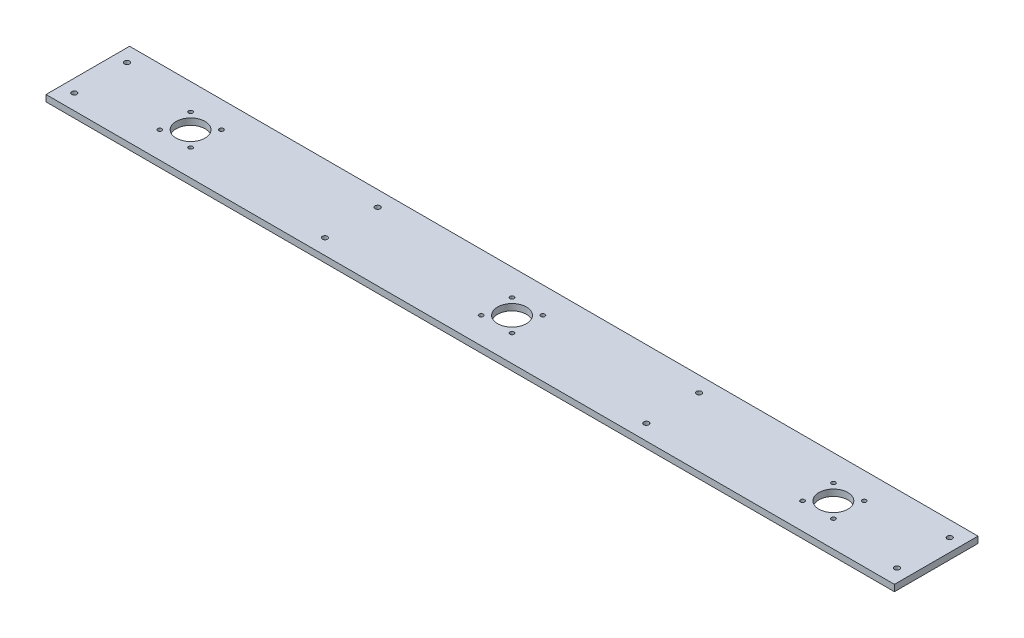
ISO-10303-21;
HEADER;
FILE_DESCRIPTION(('STEP AP214'),'2;1');
FILE_NAME('part.step','',(''),(''),'','','');
FILE_SCHEMA(('AUTOMOTIVE_DESIGN { 1 0 10303 214 1 1 1 1 }'));
ENDSEC;
DATA;
#1=APPLICATION_CONTEXT('core data for automotive mechanical design processes');
#2=APPLICATION_PROTOCOL_DEFINITION('international standard','automotive_design',2000,#1);
#3=PRODUCT_CONTEXT('',#1,'mechanical');
#4=PRODUCT('Part','Part','',(#3));
#5=PRODUCT_RELATED_PRODUCT_CATEGORY('part','',(#4));
#6=PRODUCT_DEFINITION_FORMATION('','',#4);
#7=PRODUCT_DEFINITION_CONTEXT('part definition',#1,'design');
#8=PRODUCT_DEFINITION('design','',#6,#7);
#9=PRODUCT_DEFINITION_SHAPE('','',#8);
#10=(LENGTH_UNIT() NAMED_UNIT(*) SI_UNIT(.MILLI.,.METRE.));
#11=(NAMED_UNIT(*) PLANE_ANGLE_UNIT() SI_UNIT($,.RADIAN.));
#12=(NAMED_UNIT(*) SI_UNIT($,.STERADIAN.) SOLID_ANGLE_UNIT());
#13=UNCERTAINTY_MEASURE_WITH_UNIT(LENGTH_MEASURE(1.E-05),#10,'distance_accuracy_value','');
#14=(GEOMETRIC_REPRESENTATION_CONTEXT(3) GLOBAL_UNCERTAINTY_ASSIGNED_CONTEXT((#13)) GLOBAL_UNIT_ASSIGNED_CONTEXT((#10,
#11,#12)) REPRESENTATION_CONTEXT('',''));
#15=CARTESIAN_POINT('',(0.,0.,0.));
#16=DIRECTION('',(0.,0.,1.));
#17=DIRECTION('',(1.,0.,0.));
#18=AXIS2_PLACEMENT_3D('',#15,#16,#17);
#19=CARTESIAN_POINT('',(0.,0.,0.));
#20=DIRECTION('',(0.,-1.,0.));
#21=DIRECTION('',(0.,0.,-1.));
#22=AXIS2_PLACEMENT_3D('',#19,#20,#21);
#23=PLANE('',#22);
#24=DIRECTION('',(0.,0.,-1.));
#25=VECTOR('',#24,1.);
#26=CARTESIAN_POINT('',(-419.1,0.,9.525));
#27=LINE('',#26,#25);
#28=CARTESIAN_POINT('',(-419.1,0.,-41.275));
#29=VERTEX_POINT('',#28);
#30=CARTESIAN_POINT('',(-419.1,0.,41.275));
#31=VERTEX_POINT('',#30);
#32=EDGE_CURVE('E230',#29,#31,#27,.F.);
#33=ORIENTED_EDGE('',*,*,#32,.T.);
#34=DIRECTION('',(-1.,0.,0.));
#35=VECTOR('',#34,1.);
#36=CARTESIAN_POINT('',(-311.816079656319,0.,41.275));
#37=LINE('',#36,#35);
#38=CARTESIAN_POINT('',(419.1,0.,41.275));
#39=VERTEX_POINT('',#38);
#40=EDGE_CURVE('E63',#31,#39,#37,.F.);
#41=ORIENTED_EDGE('',*,*,#40,.T.);
#42=DIRECTION('',(0.,0.,-1.));
#43=VECTOR('',#42,1.);
#44=CARTESIAN_POINT('',(419.1,0.,9.52499999999978));
#45=LINE('',#44,#43);
#46=CARTESIAN_POINT('',(419.1,0.,-41.275));
#47=VERTEX_POINT('',#46);
#48=EDGE_CURVE('E55',#47,#39,#45,.F.);
#49=ORIENTED_EDGE('',*,*,#48,.F.);
#50=DIRECTION('',(-1.,0.,0.));
#51=VECTOR('',#50,1.);
#52=CARTESIAN_POINT('',(0.,0.,-41.275));
#53=LINE('',#52,#51);
#54=EDGE_CURVE('E61',#29,#47,#53,.F.);
#55=ORIENTED_EDGE('',*,*,#54,.F.);
#56=EDGE_LOOP('',(#33,#41,#49,#55));
#57=FACE_BOUND('',#56,.T.);
#58=CARTESIAN_POINT('',(-317.5,0.,0.));
#59=DIRECTION('',(0.,1.,0.));
#60=DIRECTION('',(0.,0.,1.));
#61=AXIS2_PLACEMENT_3D('',#58,#59,#60);
#62=CIRCLE('',#61,14.2875);
#63=CARTESIAN_POINT('',(-317.5,0.,14.2875));
#64=VERTEX_POINT('',#63);
#65=EDGE_CURVE('E226',#64,#64,#62,.F.);
#66=ORIENTED_EDGE('',*,*,#65,.T.);
#67=EDGE_LOOP('',(#66));
#68=FACE_BOUND('',#67,.T.);
#69=CARTESIAN_POINT('',(-332.74,0.,15.24));
#70=DIRECTION('',(0.,1.,0.));
#71=DIRECTION('',(0.,0.,1.));
#72=AXIS2_PLACEMENT_3D('',#69,#70,#71);
#73=CIRCLE('',#72,2.032);
#74=CARTESIAN_POINT('',(-332.74,0.,17.272));
#75=VERTEX_POINT('',#74);
#76=EDGE_CURVE('E222',#75,#75,#73,.F.);
#77=ORIENTED_EDGE('',*,*,#76,.T.);
#78=EDGE_LOOP('',(#77));
#79=FACE_BOUND('',#78,.T.);
#80=CARTESIAN_POINT('',(0.,0.,0.));
#81=DIRECTION('',(0.,1.,0.));
#82=DIRECTION('',(0.,0.,1.));
#83=AXIS2_PLACEMENT_3D('',#80,#81,#82);
#84=CIRCLE('',#83,14.2875);
#85=CARTESIAN_POINT('',(0.,0.,14.2875));
#86=VERTEX_POINT('',#85);
#87=EDGE_CURVE('E218',#86,#86,#84,.F.);
#88=ORIENTED_EDGE('',*,*,#87,.T.);
#89=EDGE_LOOP('',(#88));
#90=FACE_BOUND('',#89,.T.);
#91=CARTESIAN_POINT('',(-302.26,0.,15.24));
#92=DIRECTION('',(0.,1.,0.));
#93=DIRECTION('',(0.,0.,1.));
#94=AXIS2_PLACEMENT_3D('',#91,#92,#93);
#95=CIRCLE('',#94,2.032);
#96=CARTESIAN_POINT('',(-302.26,0.,17.272));
#97=VERTEX_POINT('',#96);
#98=EDGE_CURVE('E214',#97,#97,#95,.F.);
#99=ORIENTED_EDGE('',*,*,#98,.T.);
#100=EDGE_LOOP('',(#99));
#101=FACE_BOUND('',#100,.T.);
#102=CARTESIAN_POINT('',(-302.26,0.,-15.24));
#103=DIRECTION('',(0.,1.,0.));
#104=DIRECTION('',(0.,0.,1.));
#105=AXIS2_PLACEMENT_3D('',#102,#103,#104);
#106=CIRCLE('',#105,2.032);
#107=CARTESIAN_POINT('',(-302.26,0.,-13.208));
#108=VERTEX_POINT('',#107);
#109=EDGE_CURVE('E210',#108,#108,#106,.F.);
#110=ORIENTED_EDGE('',*,*,#109,.T.);
#111=EDGE_LOOP('',(#110));
#112=FACE_BOUND('',#111,.T.);
#113=CARTESIAN_POINT('',(-332.74,0.,-15.24));
#114=DIRECTION('',(0.,1.,0.));
#115=DIRECTION('',(0.,0.,1.));
#116=AXIS2_PLACEMENT_3D('',#113,#114,#115);
#117=CIRCLE('',#116,2.032);
#118=CARTESIAN_POINT('',(-332.74,0.,-13.208));
#119=VERTEX_POINT('',#118);
#120=EDGE_CURVE('E206',#119,#119,#117,.F.);
#121=ORIENTED_EDGE('',*,*,#120,.T.);
#122=EDGE_LOOP('',(#121));
#123=FACE_BOUND('',#122,.T.);
#124=CARTESIAN_POINT('',(15.24,0.,-15.24));
#125=DIRECTION('',(0.,1.,0.));
#126=DIRECTION('',(0.,0.,1.));
#127=AXIS2_PLACEMENT_3D('',#124,#125,#126);
#128=CIRCLE('',#127,2.032);
#129=CARTESIAN_POINT('',(15.24,0.,-13.208));
#130=VERTEX_POINT('',#129);
#131=EDGE_CURVE('E202',#130,#130,#128,.F.);
#132=ORIENTED_EDGE('',*,*,#131,.T.);
#133=EDGE_LOOP('',(#132));
#134=FACE_BOUND('',#133,.T.);
#135=CARTESIAN_POINT('',(15.24,0.,15.24));
#136=DIRECTION('',(0.,1.,0.));
#137=DIRECTION('',(0.,0.,1.));
#138=AXIS2_PLACEMENT_3D('',#135,#136,#137);
#139=CIRCLE('',#138,2.032);
#140=CARTESIAN_POINT('',(15.24,0.,17.272));
#141=VERTEX_POINT('',#140);
#142=EDGE_CURVE('E198',#141,#141,#139,.F.);
#143=ORIENTED_EDGE('',*,*,#142,.T.);
#144=EDGE_LOOP('',(#143));
#145=FACE_BOUND('',#144,.T.);
#146=CARTESIAN_POINT('',(-15.24,0.,15.24));
#147=DIRECTION('',(0.,1.,0.));
#148=DIRECTION('',(0.,0.,1.));
#149=AXIS2_PLACEMENT_3D('',#146,#147,#148);
#150=CIRCLE('',#149,2.032);
#151=CARTESIAN_POINT('',(-15.24,0.,17.272));
#152=VERTEX_POINT('',#151);
#153=EDGE_CURVE('E194',#152,#152,#150,.F.);
#154=ORIENTED_EDGE('',*,*,#153,.T.);
#155=EDGE_LOOP('',(#154));
#156=FACE_BOUND('',#155,.T.);
#157=CARTESIAN_POINT('',(-15.24,0.,-15.24));
#158=DIRECTION('',(0.,1.,0.));
#159=DIRECTION('',(0.,0.,1.));
#160=AXIS2_PLACEMENT_3D('',#157,#158,#159);
#161=CIRCLE('',#160,2.032);
#162=CARTESIAN_POINT('',(-15.24,0.,-13.208));
#163=VERTEX_POINT('',#162);
#164=EDGE_CURVE('E190',#163,#163,#161,.F.);
#165=ORIENTED_EDGE('',*,*,#164,.T.);
#166=EDGE_LOOP('',(#165));
#167=FACE_BOUND('',#166,.T.);
#168=CARTESIAN_POINT('',(317.5,0.,0.));
#169=DIRECTION('',(0.,1.,0.));
#170=DIRECTION('',(0.,0.,1.));
#171=AXIS2_PLACEMENT_3D('',#168,#169,#170);
#172=CIRCLE('',#171,14.2875);
#173=CARTESIAN_POINT('',(317.5,0.,14.2875));
#174=VERTEX_POINT('',#173);
#175=EDGE_CURVE('E186',#174,#174,#172,.F.);
#176=ORIENTED_EDGE('',*,*,#175,.T.);
#177=EDGE_LOOP('',(#176));
#178=FACE_BOUND('',#177,.T.);
#179=CARTESIAN_POINT('',(332.74,0.,15.24));
#180=DIRECTION('',(0.,1.,0.));
#181=DIRECTION('',(0.,0.,1.));
#182=AXIS2_PLACEMENT_3D('',#179,#180,#181);
#183=CIRCLE('',#182,2.032);
#184=CARTESIAN_POINT('',(332.74,0.,17.272));
#185=VERTEX_POINT('',#184);
#186=EDGE_CURVE('E75',#185,#185,#183,.F.);
#187=ORIENTED_EDGE('',*,*,#186,.T.);
#188=EDGE_LOOP('',(#187));
#189=FACE_BOUND('',#188,.T.);
#190=CARTESIAN_POINT('',(302.26,0.,15.24));
#191=DIRECTION('',(0.,1.,0.));
#192=DIRECTION('',(0.,0.,1.));
#193=AXIS2_PLACEMENT_3D('',#190,#191,#192);
#194=CIRCLE('',#193,2.032);
#195=CARTESIAN_POINT('',(302.26,0.,17.272));
#196=VERTEX_POINT('',#195);
#197=EDGE_CURVE('E182',#196,#196,#194,.F.);
#198=ORIENTED_EDGE('',*,*,#197,.T.);
#199=EDGE_LOOP('',(#198));
#200=FACE_BOUND('',#199,.T.);
#201=CARTESIAN_POINT('',(302.26,0.,-15.24));
#202=DIRECTION('',(0.,1.,0.));
#203=DIRECTION('',(0.,0.,1.));
#204=AXIS2_PLACEMENT_3D('',#201,#202,#203);
#205=CIRCLE('',#204,2.032);
#206=CARTESIAN_POINT('',(302.26,0.,-13.208));
#207=VERTEX_POINT('',#206);
#208=EDGE_CURVE('E234',#207,#207,#205,.F.);
#209=ORIENTED_EDGE('',*,*,#208,.T.);
#210=EDGE_LOOP('',(#209));
#211=FACE_BOUND('',#210,.T.);
#212=CARTESIAN_POINT('',(332.74,0.,-15.24));
#213=DIRECTION('',(0.,1.,0.));
#214=DIRECTION('',(0.,0.,1.));
#215=AXIS2_PLACEMENT_3D('',#212,#213,#214);
#216=CIRCLE('',#215,2.032);
#217=CARTESIAN_POINT('',(332.74,0.,-13.208));
#218=VERTEX_POINT('',#217);
#219=EDGE_CURVE('E178',#218,#218,#216,.F.);
#220=ORIENTED_EDGE('',*,*,#219,.T.);
#221=EDGE_LOOP('',(#220));
#222=FACE_BOUND('',#221,.T.);
#223=CARTESIAN_POINT('',(-406.4,0.,-26.035));
#224=DIRECTION('',(0.,1.,0.));
#225=DIRECTION('',(0.,0.,1.));
#226=AXIS2_PLACEMENT_3D('',#223,#224,#225);
#227=CIRCLE('',#226,2.54);
#228=CARTESIAN_POINT('',(-406.4,0.,-23.495));
#229=VERTEX_POINT('',#228);
#230=EDGE_CURVE('E238',#229,#229,#227,.F.);
#231=ORIENTED_EDGE('',*,*,#230,.T.);
#232=EDGE_LOOP('',(#231));
#233=FACE_BOUND('',#232,.T.);
#234=CARTESIAN_POINT('',(-158.75,0.,26.035));
#235=DIRECTION('',(0.,1.,0.));
#236=DIRECTION('',(0.,0.,1.));
#237=AXIS2_PLACEMENT_3D('',#234,#235,#236);
#238=CIRCLE('',#237,2.54);
#239=CARTESIAN_POINT('',(-158.75,0.,28.575));
#240=VERTEX_POINT('',#239);
#241=EDGE_CURVE('E242',#240,#240,#238,.F.);
#242=ORIENTED_EDGE('',*,*,#241,.T.);
#243=EDGE_LOOP('',(#242));
#244=FACE_BOUND('',#243,.T.);
#245=CARTESIAN_POINT('',(-158.75,0.,-26.035));
#246=DIRECTION('',(0.,1.,0.));
#247=DIRECTION('',(0.,0.,1.));
#248=AXIS2_PLACEMENT_3D('',#245,#246,#247);
#249=CIRCLE('',#248,2.54);
#250=CARTESIAN_POINT('',(-158.75,0.,-23.495));
#251=VERTEX_POINT('',#250);
#252=EDGE_CURVE('E246',#251,#251,#249,.F.);
#253=ORIENTED_EDGE('',*,*,#252,.T.);
#254=EDGE_LOOP('',(#253));
#255=FACE_BOUND('',#254,.T.);
#256=CARTESIAN_POINT('',(-406.4,0.,26.035));
#257=DIRECTION('',(0.,1.,0.));
#258=DIRECTION('',(0.,0.,1.));
#259=AXIS2_PLACEMENT_3D('',#256,#257,#258);
#260=CIRCLE('',#259,2.54);
#261=CARTESIAN_POINT('',(-406.4,0.,28.575));
#262=VERTEX_POINT('',#261);
#263=EDGE_CURVE('E250',#262,#262,#260,.F.);
#264=ORIENTED_EDGE('',*,*,#263,.T.);
#265=EDGE_LOOP('',(#264));
#266=FACE_BOUND('',#265,.T.);
#267=CARTESIAN_POINT('',(406.4,0.,-26.035));
#268=DIRECTION('',(0.,1.,0.));
#269=DIRECTION('',(0.,0.,1.));
#270=AXIS2_PLACEMENT_3D('',#267,#268,#269);
#271=CIRCLE('',#270,2.54);
#272=CARTESIAN_POINT('',(406.4,0.,-23.495));
#273=VERTEX_POINT('',#272);
#274=EDGE_CURVE('E254',#273,#273,#271,.F.);
#275=ORIENTED_EDGE('',*,*,#274,.T.);
#276=EDGE_LOOP('',(#275));
#277=FACE_BOUND('',#276,.T.);
#278=CARTESIAN_POINT('',(158.75,0.,26.035));
#279=DIRECTION('',(0.,1.,0.));
#280=DIRECTION('',(0.,0.,1.));
#281=AXIS2_PLACEMENT_3D('',#278,#279,#280);
#282=CIRCLE('',#281,2.54);
#283=CARTESIAN_POINT('',(158.75,0.,28.575));
#284=VERTEX_POINT('',#283);
#285=EDGE_CURVE('E258',#284,#284,#282,.F.);
#286=ORIENTED_EDGE('',*,*,#285,.T.);
#287=EDGE_LOOP('',(#286));
#288=FACE_BOUND('',#287,.T.);
#289=CARTESIAN_POINT('',(158.75,0.,-26.035));
#290=DIRECTION('',(0.,1.,0.));
#291=DIRECTION('',(0.,0.,1.));
#292=AXIS2_PLACEMENT_3D('',#289,#290,#291);
#293=CIRCLE('',#292,2.54);
#294=CARTESIAN_POINT('',(158.75,0.,-23.495));
#295=VERTEX_POINT('',#294);
#296=EDGE_CURVE('E261',#295,#295,#293,.F.);
#297=ORIENTED_EDGE('',*,*,#296,.T.);
#298=EDGE_LOOP('',(#297));
#299=FACE_BOUND('',#298,.T.);
#300=CARTESIAN_POINT('',(406.4,0.,26.035));
#301=DIRECTION('',(0.,1.,0.));
#302=DIRECTION('',(0.,0.,1.));
#303=AXIS2_PLACEMENT_3D('',#300,#301,#302);
#304=CIRCLE('',#303,2.54);
#305=CARTESIAN_POINT('',(406.4,0.,28.575));
#306=VERTEX_POINT('',#305);
#307=EDGE_CURVE('E19',#306,#306,#304,.F.);
#308=ORIENTED_EDGE('',*,*,#307,.T.);
#309=EDGE_LOOP('',(#308));
#310=FACE_BOUND('',#309,.T.);
#311=ADVANCED_FACE('F16',(#57,#68,#79,#90,#101,#112,#123,#134,#145,#156,#167,#178,#189,#200,
#211,#222,#233,#244,#255,#266,#277,#288,#299,#310),#23,.F.);
#312=CARTESIAN_POINT('',(406.4,500000.,26.035));
#313=DIRECTION('',(0.,1.,0.));
#314=DIRECTION('',(0.,0.,1.));
#315=AXIS2_PLACEMENT_3D('',#312,#313,#314);
#316=CYLINDRICAL_SURFACE('',#315,2.54);
#317=CARTESIAN_POINT('',(406.4,-6.34999999999764,26.035));
#318=DIRECTION('',(0.,1.,0.));
#319=DIRECTION('',(0.,0.,1.));
#320=AXIS2_PLACEMENT_3D('',#317,#318,#319);
#321=CIRCLE('',#320,2.54);
#322=CARTESIAN_POINT('',(406.4,-6.34999999999764,28.575));
#323=VERTEX_POINT('',#322);
#324=EDGE_CURVE('E174',#323,#323,#321,.T.);
#325=ORIENTED_EDGE('',*,*,#324,.F.);
#326=EDGE_LOOP('',(#325));
#327=FACE_BOUND('',#326,.T.);
#328=ORIENTED_EDGE('',*,*,#307,.F.);
#329=EDGE_LOOP('',(#328));
#330=FACE_BOUND('',#329,.T.);
#331=ADVANCED_FACE('F271',(#327,#330),#316,.F.);
#332=CARTESIAN_POINT('',(158.75,500000.,-26.035));
#333=DIRECTION('',(0.,1.,0.));
#334=DIRECTION('',(0.,0.,1.));
#335=AXIS2_PLACEMENT_3D('',#332,#333,#334);
#336=CYLINDRICAL_SURFACE('',#335,2.54);
#337=CARTESIAN_POINT('',(158.75,-6.34999999999764,-26.035));
#338=DIRECTION('',(0.,1.,0.));
#339=DIRECTION('',(0.,0.,1.));
#340=AXIS2_PLACEMENT_3D('',#337,#338,#339);
#341=CIRCLE('',#340,2.54);
#342=CARTESIAN_POINT('',(158.75,-6.34999999999764,-23.495));
#343=VERTEX_POINT('',#342);
#344=EDGE_CURVE('E170',#343,#343,#341,.T.);
#345=ORIENTED_EDGE('',*,*,#344,.F.);
#346=EDGE_LOOP('',(#345));
#347=FACE_BOUND('',#346,.T.);
#348=ORIENTED_EDGE('',*,*,#296,.F.);
#349=EDGE_LOOP('',(#348));
#350=FACE_BOUND('',#349,.T.);
#351=ADVANCED_FACE('F273',(#347,#350),#336,.F.);
#352=CARTESIAN_POINT('',(158.75,500000.,26.035));
#353=DIRECTION('',(0.,1.,0.));
#354=DIRECTION('',(0.,0.,1.));
#355=AXIS2_PLACEMENT_3D('',#352,#353,#354);
#356=CYLINDRICAL_SURFACE('',#355,2.54);
#357=CARTESIAN_POINT('',(158.75,-6.34999999999764,26.035));
#358=DIRECTION('',(0.,1.,0.));
#359=DIRECTION('',(0.,0.,1.));
#360=AXIS2_PLACEMENT_3D('',#357,#358,#359);
#361=CIRCLE('',#360,2.54);
#362=CARTESIAN_POINT('',(158.75,-6.34999999999764,28.575));
#363=VERTEX_POINT('',#362);
#364=EDGE_CURVE('E166',#363,#363,#361,.T.);
#365=ORIENTED_EDGE('',*,*,#364,.F.);
#366=EDGE_LOOP('',(#365));
#367=FACE_BOUND('',#366,.T.);
#368=ORIENTED_EDGE('',*,*,#285,.F.);
#369=EDGE_LOOP('',(#368));
#370=FACE_BOUND('',#369,.T.);
#371=ADVANCED_FACE('F280',(#367,#370),#356,.F.);
#372=CARTESIAN_POINT('',(406.4,500000.,-26.035));
#373=DIRECTION('',(0.,1.,0.));
#374=DIRECTION('',(0.,0.,1.));
#375=AXIS2_PLACEMENT_3D('',#372,#373,#374);
#376=CYLINDRICAL_SURFACE('',#375,2.54);
#377=CARTESIAN_POINT('',(406.4,-6.34999999999764,-26.035));
#378=DIRECTION('',(0.,1.,0.));
#379=DIRECTION('',(0.,0.,1.));
#380=AXIS2_PLACEMENT_3D('',#377,#378,#379);
#381=CIRCLE('',#380,2.54);
#382=CARTESIAN_POINT('',(406.4,-6.34999999999764,-23.495));
#383=VERTEX_POINT('',#382);
#384=EDGE_CURVE('E162',#383,#383,#381,.T.);
#385=ORIENTED_EDGE('',*,*,#384,.F.);
#386=EDGE_LOOP('',(#385));
#387=FACE_BOUND('',#386,.T.);
#388=ORIENTED_EDGE('',*,*,#274,.F.);
#389=EDGE_LOOP('',(#388));
#390=FACE_BOUND('',#389,.T.);
#391=ADVANCED_FACE('F378',(#387,#390),#376,.F.);
#392=CARTESIAN_POINT('',(-406.4,500000.,26.035));
#393=DIRECTION('',(0.,1.,0.));
#394=DIRECTION('',(0.,0.,1.));
#395=AXIS2_PLACEMENT_3D('',#392,#393,#394);
#396=CYLINDRICAL_SURFACE('',#395,2.54);
#397=CARTESIAN_POINT('',(-406.4,-6.34999999999764,26.035));
#398=DIRECTION('',(0.,1.,0.));
#399=DIRECTION('',(0.,0.,1.));
#400=AXIS2_PLACEMENT_3D('',#397,#398,#399);
#401=CIRCLE('',#400,2.54);
#402=CARTESIAN_POINT('',(-406.4,-6.34999999999764,28.575));
#403=VERTEX_POINT('',#402);
#404=EDGE_CURVE('E158',#403,#403,#401,.T.);
#405=ORIENTED_EDGE('',*,*,#404,.F.);
#406=EDGE_LOOP('',(#405));
#407=FACE_BOUND('',#406,.T.);
#408=ORIENTED_EDGE('',*,*,#263,.F.);
#409=EDGE_LOOP('',(#408));
#410=FACE_BOUND('',#409,.T.);
#411=ADVANCED_FACE('F374',(#407,#410),#396,.F.);
#412=CARTESIAN_POINT('',(-158.75,500000.,-26.035));
#413=DIRECTION('',(0.,1.,0.));
#414=DIRECTION('',(0.,0.,1.));
#415=AXIS2_PLACEMENT_3D('',#412,#413,#414);
#416=CYLINDRICAL_SURFACE('',#415,2.54);
#417=CARTESIAN_POINT('',(-158.75,-6.34999999999764,-26.035));
#418=DIRECTION('',(0.,1.,0.));
#419=DIRECTION('',(0.,0.,1.));
#420=AXIS2_PLACEMENT_3D('',#417,#418,#419);
#421=CIRCLE('',#420,2.54);
#422=CARTESIAN_POINT('',(-158.75,-6.34999999999764,-23.495));
#423=VERTEX_POINT('',#422);
#424=EDGE_CURVE('E154',#423,#423,#421,.T.);
#425=ORIENTED_EDGE('',*,*,#424,.F.);
#426=EDGE_LOOP('',(#425));
#427=FACE_BOUND('',#426,.T.);
#428=ORIENTED_EDGE('',*,*,#252,.F.);
#429=EDGE_LOOP('',(#428));
#430=FACE_BOUND('',#429,.T.);
#431=ADVANCED_FACE('F370',(#427,#430),#416,.F.);
#432=CARTESIAN_POINT('',(-158.75,500000.,26.035));
#433=DIRECTION('',(0.,1.,0.));
#434=DIRECTION('',(0.,0.,1.));
#435=AXIS2_PLACEMENT_3D('',#432,#433,#434);
#436=CYLINDRICAL_SURFACE('',#435,2.54);
#437=CARTESIAN_POINT('',(-158.75,-6.34999999999764,26.035));
#438=DIRECTION('',(0.,1.,0.));
#439=DIRECTION('',(0.,0.,1.));
#440=AXIS2_PLACEMENT_3D('',#437,#438,#439);
#441=CIRCLE('',#440,2.54);
#442=CARTESIAN_POINT('',(-158.75,-6.34999999999764,28.575));
#443=VERTEX_POINT('',#442);
#444=EDGE_CURVE('E150',#443,#443,#441,.T.);
#445=ORIENTED_EDGE('',*,*,#444,.F.);
#446=EDGE_LOOP('',(#445));
#447=FACE_BOUND('',#446,.T.);
#448=ORIENTED_EDGE('',*,*,#241,.F.);
#449=EDGE_LOOP('',(#448));
#450=FACE_BOUND('',#449,.T.);
#451=ADVANCED_FACE('F366',(#447,#450),#436,.F.);
#452=CARTESIAN_POINT('',(-406.4,500000.,-26.035));
#453=DIRECTION('',(0.,1.,0.));
#454=DIRECTION('',(0.,0.,1.));
#455=AXIS2_PLACEMENT_3D('',#452,#453,#454);
#456=CYLINDRICAL_SURFACE('',#455,2.54);
#457=CARTESIAN_POINT('',(-406.4,-6.34999999999764,-26.035));
#458=DIRECTION('',(0.,1.,0.));
#459=DIRECTION('',(0.,0.,1.));
#460=AXIS2_PLACEMENT_3D('',#457,#458,#459);
#461=CIRCLE('',#460,2.54);
#462=CARTESIAN_POINT('',(-406.4,-6.34999999999764,-23.495));
#463=VERTEX_POINT('',#462);
#464=EDGE_CURVE('E146',#463,#463,#461,.T.);
#465=ORIENTED_EDGE('',*,*,#464,.F.);
#466=EDGE_LOOP('',(#465));
#467=FACE_BOUND('',#466,.T.);
#468=ORIENTED_EDGE('',*,*,#230,.F.);
#469=EDGE_LOOP('',(#468));
#470=FACE_BOUND('',#469,.T.);
#471=ADVANCED_FACE('F362',(#467,#470),#456,.F.);
#472=CARTESIAN_POINT('',(302.26,500000.,-15.24));
#473=DIRECTION('',(0.,1.,0.));
#474=DIRECTION('',(0.,0.,1.));
#475=AXIS2_PLACEMENT_3D('',#472,#473,#474);
#476=CYLINDRICAL_SURFACE('',#475,2.032);
#477=CARTESIAN_POINT('',(302.26,-6.34999999999764,-15.24));
#478=DIRECTION('',(0.,1.,0.));
#479=DIRECTION('',(0.,0.,1.));
#480=AXIS2_PLACEMENT_3D('',#477,#478,#479);
#481=CIRCLE('',#480,2.032);
#482=CARTESIAN_POINT('',(302.26,-6.34999999999764,-13.208));
#483=VERTEX_POINT('',#482);
#484=EDGE_CURVE('E142',#483,#483,#481,.T.);
#485=ORIENTED_EDGE('',*,*,#484,.F.);
#486=EDGE_LOOP('',(#485));
#487=FACE_BOUND('',#486,.T.);
#488=ORIENTED_EDGE('',*,*,#208,.F.);
#489=EDGE_LOOP('',(#488));
#490=FACE_BOUND('',#489,.T.);
#491=ADVANCED_FACE('F358',(#487,#490),#476,.F.);
#492=CARTESIAN_POINT('',(332.74,500000.,15.24));
#493=DIRECTION('',(0.,1.,0.));
#494=DIRECTION('',(0.,0.,1.));
#495=AXIS2_PLACEMENT_3D('',#492,#493,#494);
#496=CYLINDRICAL_SURFACE('',#495,2.032);
#497=CARTESIAN_POINT('',(332.74,-6.34999999999764,15.24));
#498=DIRECTION('',(0.,1.,0.));
#499=DIRECTION('',(0.,0.,1.));
#500=AXIS2_PLACEMENT_3D('',#497,#498,#499);
#501=CIRCLE('',#500,2.032);
#502=CARTESIAN_POINT('',(332.74,-6.34999999999764,17.272));
#503=VERTEX_POINT('',#502);
#504=EDGE_CURVE('E137',#503,#503,#501,.T.);
#505=ORIENTED_EDGE('',*,*,#504,.F.);
#506=EDGE_LOOP('',(#505));
#507=FACE_BOUND('',#506,.T.);
#508=ORIENTED_EDGE('',*,*,#186,.F.);
#509=EDGE_LOOP('',(#508));
#510=FACE_BOUND('',#509,.T.);
#511=ADVANCED_FACE('F355',(#507,#510),#496,.F.);
#512=CARTESIAN_POINT('',(0.,-6.35,-41.275));
#513=DIRECTION('',(0.,0.,-1.));
#514=DIRECTION('',(-1.,0.,0.));
#515=AXIS2_PLACEMENT_3D('',#512,#513,#514);
#516=PLANE('',#515);
#517=DIRECTION('',(1.,0.,0.));
#518=VECTOR('',#517,1.);
#519=CARTESIAN_POINT('',(0.,-6.35,-41.275));
#520=LINE('',#519,#518);
#521=CARTESIAN_POINT('',(-419.1,-6.35,-41.275));
#522=VERTEX_POINT('',#521);
#523=CARTESIAN_POINT('',(419.1,-6.35,-41.275));
#524=VERTEX_POINT('',#523);
#525=EDGE_CURVE('E141',#522,#524,#520,.T.);
#526=ORIENTED_EDGE('',*,*,#525,.F.);
#527=DIRECTION('',(0.,1.,0.));
#528=VECTOR('',#527,1.);
#529=CARTESIAN_POINT('',(-419.1,-6.35,-41.275));
#530=LINE('',#529,#528);
#531=EDGE_CURVE('E72',#522,#29,#530,.T.);
#532=ORIENTED_EDGE('',*,*,#531,.T.);
#533=ORIENTED_EDGE('',*,*,#54,.T.);
#534=DIRECTION('',(0.,1.,0.));
#535=VECTOR('',#534,1.);
#536=CARTESIAN_POINT('',(419.1,-6.35,-41.275));
#537=LINE('',#536,#535);
#538=EDGE_CURVE('E66',#524,#47,#537,.T.);
#539=ORIENTED_EDGE('',*,*,#538,.F.);
#540=EDGE_LOOP('',(#526,#532,#533,#539));
#541=FACE_BOUND('',#540,.T.);
#542=ADVANCED_FACE('F69',(#541),#516,.T.);
#543=CARTESIAN_POINT('',(419.1,-6.35,9.52499999999978));
#544=DIRECTION('',(1.,0.,0.));
#545=DIRECTION('',(0.,0.,-1.));
#546=AXIS2_PLACEMENT_3D('',#543,#544,#545);
#547=PLANE('',#546);
#548=DIRECTION('',(0.,0.,-1.));
#549=VECTOR('',#548,1.);
#550=CARTESIAN_POINT('',(419.1,-6.35,0.));
#551=LINE('',#550,#549);
#552=CARTESIAN_POINT('',(419.1,-6.35,41.275));
#553=VERTEX_POINT('',#552);
#554=EDGE_CURVE('E79',#524,#553,#551,.F.);
#555=ORIENTED_EDGE('',*,*,#554,.F.);
#556=ORIENTED_EDGE('',*,*,#538,.T.);
#557=ORIENTED_EDGE('',*,*,#48,.T.);
#558=DIRECTION('',(0.,1.,0.));
#559=VECTOR('',#558,1.);
#560=CARTESIAN_POINT('',(419.1,-6.35,41.275));
#561=LINE('',#560,#559);
#562=EDGE_CURVE('E82',#39,#553,#561,.F.);
#563=ORIENTED_EDGE('',*,*,#562,.T.);
#564=EDGE_LOOP('',(#555,#556,#557,#563));
#565=FACE_BOUND('',#564,.T.);
#566=ADVANCED_FACE('F77',(#565),#547,.T.);
#567=CARTESIAN_POINT('',(-311.816079656319,-6.35,41.275));
#568=DIRECTION('',(0.,0.,-1.));
#569=DIRECTION('',(-1.,0.,0.));
#570=AXIS2_PLACEMENT_3D('',#567,#568,#569);
#571=PLANE('',#570);
#572=DIRECTION('',(0.,1.,0.));
#573=VECTOR('',#572,1.);
#574=CARTESIAN_POINT('',(-419.1,-6.35,41.275));
#575=LINE('',#574,#573);
#576=CARTESIAN_POINT('',(-419.1,-6.35,41.275));
#577=VERTEX_POINT('',#576);
#578=EDGE_CURVE('E35',#31,#577,#575,.F.);
#579=ORIENTED_EDGE('',*,*,#578,.T.);
#580=DIRECTION('',(1.,0.,0.));
#581=VECTOR('',#580,1.);
#582=CARTESIAN_POINT('',(0.,-6.35,41.275));
#583=LINE('',#582,#581);
#584=EDGE_CURVE('E649',#553,#577,#583,.F.);
#585=ORIENTED_EDGE('',*,*,#584,.F.);
#586=ORIENTED_EDGE('',*,*,#562,.F.);
#587=ORIENTED_EDGE('',*,*,#40,.F.);
#588=EDGE_LOOP('',(#579,#585,#586,#587));
#589=FACE_BOUND('',#588,.T.);
#590=ADVANCED_FACE('F347',(#589),#571,.F.);
#591=CARTESIAN_POINT('',(-419.1,-6.35,9.525));
#592=DIRECTION('',(1.,0.,0.));
#593=DIRECTION('',(0.,0.,-1.));
#594=AXIS2_PLACEMENT_3D('',#591,#592,#593);
#595=PLANE('',#594);
#596=ORIENTED_EDGE('',*,*,#531,.F.);
#597=DIRECTION('',(0.,0.,-1.));
#598=VECTOR('',#597,1.);
#599=CARTESIAN_POINT('',(-419.1,-6.35,0.));
#600=LINE('',#599,#598);
#601=EDGE_CURVE('E136',#577,#522,#600,.T.);
#602=ORIENTED_EDGE('',*,*,#601,.F.);
#603=ORIENTED_EDGE('',*,*,#578,.F.);
#604=ORIENTED_EDGE('',*,*,#32,.F.);
#605=EDGE_LOOP('',(#596,#602,#603,#604));
#606=FACE_BOUND('',#605,.T.);
#607=ADVANCED_FACE('F343',(#606),#595,.F.);
#608=CARTESIAN_POINT('',(-317.5,500000.,0.));
#609=DIRECTION('',(0.,1.,0.));
#610=DIRECTION('',(0.,0.,1.));
#611=AXIS2_PLACEMENT_3D('',#608,#609,#610);
#612=CYLINDRICAL_SURFACE('',#611,14.2875);
#613=CARTESIAN_POINT('',(-317.5,-6.34999999999764,0.));
#614=DIRECTION('',(0.,1.,0.));
#615=DIRECTION('',(0.,0.,1.));
#616=AXIS2_PLACEMENT_3D('',#613,#614,#615);
#617=CIRCLE('',#616,14.2875);
#618=CARTESIAN_POINT('',(-317.5,-6.34999999999764,14.2875));
#619=VERTEX_POINT('',#618);
#620=EDGE_CURVE('E132',#619,#619,#617,.T.);
#621=ORIENTED_EDGE('',*,*,#620,.F.);
#622=EDGE_LOOP('',(#621));
#623=FACE_BOUND('',#622,.T.);
#624=ORIENTED_EDGE('',*,*,#65,.F.);
#625=EDGE_LOOP('',(#624));
#626=FACE_BOUND('',#625,.T.);
#627=ADVANCED_FACE('F339',(#623,#626),#612,.F.);
#628=CARTESIAN_POINT('',(-332.74,500000.,15.24));
#629=DIRECTION('',(0.,1.,0.));
#630=DIRECTION('',(0.,0.,1.));
#631=AXIS2_PLACEMENT_3D('',#628,#629,#630);
#632=CYLINDRICAL_SURFACE('',#631,2.032);
#633=CARTESIAN_POINT('',(-332.74,-6.34999999999764,15.24));
#634=DIRECTION('',(0.,1.,0.));
#635=DIRECTION('',(0.,0.,1.));
#636=AXIS2_PLACEMENT_3D('',#633,#634,#635);
#637=CIRCLE('',#636,2.032);
#638=CARTESIAN_POINT('',(-332.74,-6.34999999999764,17.272));
#639=VERTEX_POINT('',#638);
#640=EDGE_CURVE('E128',#639,#639,#637,.T.);
#641=ORIENTED_EDGE('',*,*,#640,.F.);
#642=EDGE_LOOP('',(#641));
#643=FACE_BOUND('',#642,.T.);
#644=ORIENTED_EDGE('',*,*,#76,.F.);
#645=EDGE_LOOP('',(#644));
#646=FACE_BOUND('',#645,.T.);
#647=ADVANCED_FACE('F335',(#643,#646),#632,.F.);
#648=CARTESIAN_POINT('',(0.,500000.,0.));
#649=DIRECTION('',(0.,1.,0.));
#650=DIRECTION('',(0.,0.,1.));
#651=AXIS2_PLACEMENT_3D('',#648,#649,#650);
#652=CYLINDRICAL_SURFACE('',#651,14.2875);
#653=CARTESIAN_POINT('',(0.,-6.34999999999764,0.));
#654=DIRECTION('',(0.,1.,0.));
#655=DIRECTION('',(0.,0.,1.));
#656=AXIS2_PLACEMENT_3D('',#653,#654,#655);
#657=CIRCLE('',#656,14.2875);
#658=CARTESIAN_POINT('',(0.,-6.34999999999764,14.2875));
#659=VERTEX_POINT('',#658);
#660=EDGE_CURVE('E124',#659,#659,#657,.T.);
#661=ORIENTED_EDGE('',*,*,#660,.F.);
#662=EDGE_LOOP('',(#661));
#663=FACE_BOUND('',#662,.T.);
#664=ORIENTED_EDGE('',*,*,#87,.F.);
#665=EDGE_LOOP('',(#664));
#666=FACE_BOUND('',#665,.T.);
#667=ADVANCED_FACE('F331',(#663,#666),#652,.F.);
#668=CARTESIAN_POINT('',(-302.26,500000.,15.24));
#669=DIRECTION('',(0.,1.,0.));
#670=DIRECTION('',(0.,0.,1.));
#671=AXIS2_PLACEMENT_3D('',#668,#669,#670);
#672=CYLINDRICAL_SURFACE('',#671,2.032);
#673=CARTESIAN_POINT('',(-302.26,-6.34999999999764,15.24));
#674=DIRECTION('',(0.,1.,0.));
#675=DIRECTION('',(0.,0.,1.));
#676=AXIS2_PLACEMENT_3D('',#673,#674,#675);
#677=CIRCLE('',#676,2.032);
#678=CARTESIAN_POINT('',(-302.26,-6.34999999999764,17.272));
#679=VERTEX_POINT('',#678);
#680=EDGE_CURVE('E120',#679,#679,#677,.T.);
#681=ORIENTED_EDGE('',*,*,#680,.F.);
#682=EDGE_LOOP('',(#681));
#683=FACE_BOUND('',#682,.T.);
#684=ORIENTED_EDGE('',*,*,#98,.F.);
#685=EDGE_LOOP('',(#684));
#686=FACE_BOUND('',#685,.T.);
#687=ADVANCED_FACE('F327',(#683,#686),#672,.F.);
#688=CARTESIAN_POINT('',(-302.26,500000.,-15.24));
#689=DIRECTION('',(0.,1.,0.));
#690=DIRECTION('',(0.,0.,1.));
#691=AXIS2_PLACEMENT_3D('',#688,#689,#690);
#692=CYLINDRICAL_SURFACE('',#691,2.032);
#693=CARTESIAN_POINT('',(-302.26,-6.34999999999764,-15.24));
#694=DIRECTION('',(0.,1.,0.));
#695=DIRECTION('',(0.,0.,1.));
#696=AXIS2_PLACEMENT_3D('',#693,#694,#695);
#697=CIRCLE('',#696,2.032);
#698=CARTESIAN_POINT('',(-302.26,-6.34999999999764,-13.208));
#699=VERTEX_POINT('',#698);
#700=EDGE_CURVE('E116',#699,#699,#697,.T.);
#701=ORIENTED_EDGE('',*,*,#700,.F.);
#702=EDGE_LOOP('',(#701));
#703=FACE_BOUND('',#702,.T.);
#704=ORIENTED_EDGE('',*,*,#109,.F.);
#705=EDGE_LOOP('',(#704));
#706=FACE_BOUND('',#705,.T.);
#707=ADVANCED_FACE('F323',(#703,#706),#692,.F.);
#708=CARTESIAN_POINT('',(-332.74,500000.,-15.24));
#709=DIRECTION('',(0.,1.,0.));
#710=DIRECTION('',(0.,0.,1.));
#711=AXIS2_PLACEMENT_3D('',#708,#709,#710);
#712=CYLINDRICAL_SURFACE('',#711,2.032);
#713=CARTESIAN_POINT('',(-332.74,-6.34999999999764,-15.24));
#714=DIRECTION('',(0.,1.,0.));
#715=DIRECTION('',(0.,0.,1.));
#716=AXIS2_PLACEMENT_3D('',#713,#714,#715);
#717=CIRCLE('',#716,2.032);
#718=CARTESIAN_POINT('',(-332.74,-6.34999999999764,-13.208));
#719=VERTEX_POINT('',#718);
#720=EDGE_CURVE('E112',#719,#719,#717,.T.);
#721=ORIENTED_EDGE('',*,*,#720,.F.);
#722=EDGE_LOOP('',(#721));
#723=FACE_BOUND('',#722,.T.);
#724=ORIENTED_EDGE('',*,*,#120,.F.);
#725=EDGE_LOOP('',(#724));
#726=FACE_BOUND('',#725,.T.);
#727=ADVANCED_FACE('F319',(#723,#726),#712,.F.);
#728=CARTESIAN_POINT('',(15.24,500000.,-15.24));
#729=DIRECTION('',(0.,1.,0.));
#730=DIRECTION('',(0.,0.,1.));
#731=AXIS2_PLACEMENT_3D('',#728,#729,#730);
#732=CYLINDRICAL_SURFACE('',#731,2.032);
#733=CARTESIAN_POINT('',(15.24,-6.34999999999764,-15.24));
#734=DIRECTION('',(0.,1.,0.));
#735=DIRECTION('',(0.,0.,1.));
#736=AXIS2_PLACEMENT_3D('',#733,#734,#735);
#737=CIRCLE('',#736,2.032);
#738=CARTESIAN_POINT('',(15.24,-6.34999999999764,-13.208));
#739=VERTEX_POINT('',#738);
#740=EDGE_CURVE('E108',#739,#739,#737,.T.);
#741=ORIENTED_EDGE('',*,*,#740,.F.);
#742=EDGE_LOOP('',(#741));
#743=FACE_BOUND('',#742,.T.);
#744=ORIENTED_EDGE('',*,*,#131,.F.);
#745=EDGE_LOOP('',(#744));
#746=FACE_BOUND('',#745,.T.);
#747=ADVANCED_FACE('F315',(#743,#746),#732,.F.);
#748=CARTESIAN_POINT('',(15.24,500000.,15.24));
#749=DIRECTION('',(0.,1.,0.));
#750=DIRECTION('',(0.,0.,1.));
#751=AXIS2_PLACEMENT_3D('',#748,#749,#750);
#752=CYLINDRICAL_SURFACE('',#751,2.032);
#753=CARTESIAN_POINT('',(15.24,-6.34999999999764,15.24));
#754=DIRECTION('',(0.,1.,0.));
#755=DIRECTION('',(0.,0.,1.));
#756=AXIS2_PLACEMENT_3D('',#753,#754,#755);
#757=CIRCLE('',#756,2.032);
#758=CARTESIAN_POINT('',(15.24,-6.34999999999764,17.272));
#759=VERTEX_POINT('',#758);
#760=EDGE_CURVE('E104',#759,#759,#757,.T.);
#761=ORIENTED_EDGE('',*,*,#760,.F.);
#762=EDGE_LOOP('',(#761));
#763=FACE_BOUND('',#762,.T.);
#764=ORIENTED_EDGE('',*,*,#142,.F.);
#765=EDGE_LOOP('',(#764));
#766=FACE_BOUND('',#765,.T.);
#767=ADVANCED_FACE('F311',(#763,#766),#752,.F.);
#768=CARTESIAN_POINT('',(-15.24,500000.,15.24));
#769=DIRECTION('',(0.,1.,0.));
#770=DIRECTION('',(0.,0.,1.));
#771=AXIS2_PLACEMENT_3D('',#768,#769,#770);
#772=CYLINDRICAL_SURFACE('',#771,2.032);
#773=CARTESIAN_POINT('',(-15.24,-6.34999999999764,15.24));
#774=DIRECTION('',(0.,1.,0.));
#775=DIRECTION('',(0.,0.,1.));
#776=AXIS2_PLACEMENT_3D('',#773,#774,#775);
#777=CIRCLE('',#776,2.032);
#778=CARTESIAN_POINT('',(-15.24,-6.34999999999764,17.272));
#779=VERTEX_POINT('',#778);
#780=EDGE_CURVE('E100',#779,#779,#777,.T.);
#781=ORIENTED_EDGE('',*,*,#780,.F.);
#782=EDGE_LOOP('',(#781));
#783=FACE_BOUND('',#782,.T.);
#784=ORIENTED_EDGE('',*,*,#153,.F.);
#785=EDGE_LOOP('',(#784));
#786=FACE_BOUND('',#785,.T.);
#787=ADVANCED_FACE('F307',(#783,#786),#772,.F.);
#788=CARTESIAN_POINT('',(-15.24,500000.,-15.24));
#789=DIRECTION('',(0.,1.,0.));
#790=DIRECTION('',(0.,0.,1.));
#791=AXIS2_PLACEMENT_3D('',#788,#789,#790);
#792=CYLINDRICAL_SURFACE('',#791,2.032);
#793=CARTESIAN_POINT('',(-15.24,-6.34999999999764,-15.24));
#794=DIRECTION('',(0.,1.,0.));
#795=DIRECTION('',(0.,0.,1.));
#796=AXIS2_PLACEMENT_3D('',#793,#794,#795);
#797=CIRCLE('',#796,2.032);
#798=CARTESIAN_POINT('',(-15.24,-6.34999999999764,-13.208));
#799=VERTEX_POINT('',#798);
#800=EDGE_CURVE('E96',#799,#799,#797,.T.);
#801=ORIENTED_EDGE('',*,*,#800,.F.);
#802=EDGE_LOOP('',(#801));
#803=FACE_BOUND('',#802,.T.);
#804=ORIENTED_EDGE('',*,*,#164,.F.);
#805=EDGE_LOOP('',(#804));
#806=FACE_BOUND('',#805,.T.);
#807=ADVANCED_FACE('F303',(#803,#806),#792,.F.);
#808=CARTESIAN_POINT('',(317.5,500000.,0.));
#809=DIRECTION('',(0.,1.,0.));
#810=DIRECTION('',(0.,0.,1.));
#811=AXIS2_PLACEMENT_3D('',#808,#809,#810);
#812=CYLINDRICAL_SURFACE('',#811,14.2875);
#813=CARTESIAN_POINT('',(317.5,-6.34999999999764,0.));
#814=DIRECTION('',(0.,1.,0.));
#815=DIRECTION('',(0.,0.,1.));
#816=AXIS2_PLACEMENT_3D('',#813,#814,#815);
#817=CIRCLE('',#816,14.2875);
#818=CARTESIAN_POINT('',(317.5,-6.34999999999764,14.2875));
#819=VERTEX_POINT('',#818);
#820=EDGE_CURVE('E92',#819,#819,#817,.T.);
#821=ORIENTED_EDGE('',*,*,#820,.F.);
#822=EDGE_LOOP('',(#821));
#823=FACE_BOUND('',#822,.T.);
#824=ORIENTED_EDGE('',*,*,#175,.F.);
#825=EDGE_LOOP('',(#824));
#826=FACE_BOUND('',#825,.T.);
#827=ADVANCED_FACE('F299',(#823,#826),#812,.F.);
#828=CARTESIAN_POINT('',(302.26,500000.,15.24));
#829=DIRECTION('',(0.,1.,0.));
#830=DIRECTION('',(0.,0.,1.));
#831=AXIS2_PLACEMENT_3D('',#828,#829,#830);
#832=CYLINDRICAL_SURFACE('',#831,2.032);
#833=CARTESIAN_POINT('',(302.26,-6.34999999999764,15.24));
#834=DIRECTION('',(0.,1.,0.));
#835=DIRECTION('',(0.,0.,1.));
#836=AXIS2_PLACEMENT_3D('',#833,#834,#835);
#837=CIRCLE('',#836,2.032);
#838=CARTESIAN_POINT('',(302.26,-6.34999999999764,17.272));
#839=VERTEX_POINT('',#838);
#840=EDGE_CURVE('E26',#839,#839,#837,.T.);
#841=ORIENTED_EDGE('',*,*,#840,.F.);
#842=EDGE_LOOP('',(#841));
#843=FACE_BOUND('',#842,.T.);
#844=ORIENTED_EDGE('',*,*,#197,.F.);
#845=EDGE_LOOP('',(#844));
#846=FACE_BOUND('',#845,.T.);
#847=ADVANCED_FACE('F292',(#843,#846),#832,.F.);
#848=CARTESIAN_POINT('',(332.74,500000.,-15.24));
#849=DIRECTION('',(0.,1.,0.));
#850=DIRECTION('',(0.,0.,1.));
#851=AXIS2_PLACEMENT_3D('',#848,#849,#850);
#852=CYLINDRICAL_SURFACE('',#851,2.032);
#853=CARTESIAN_POINT('',(332.74,-6.34999999999764,-15.24));
#854=DIRECTION('',(0.,1.,0.));
#855=DIRECTION('',(0.,0.,1.));
#856=AXIS2_PLACEMENT_3D('',#853,#854,#855);
#857=CIRCLE('',#856,2.032);
#858=CARTESIAN_POINT('',(332.74,-6.34999999999764,-13.208));
#859=VERTEX_POINT('',#858);
#860=EDGE_CURVE('E10',#859,#859,#857,.T.);
#861=ORIENTED_EDGE('',*,*,#860,.F.);
#862=EDGE_LOOP('',(#861));
#863=FACE_BOUND('',#862,.T.);
#864=ORIENTED_EDGE('',*,*,#219,.F.);
#865=EDGE_LOOP('',(#864));
#866=FACE_BOUND('',#865,.T.);
#867=ADVANCED_FACE('F286',(#863,#866),#852,.F.);
#868=CARTESIAN_POINT('',(0.,-6.35,0.));
#869=DIRECTION('',(0.,-1.,0.));
#870=DIRECTION('',(0.,0.,-1.));
#871=AXIS2_PLACEMENT_3D('',#868,#869,#870);
#872=PLANE('',#871);
#873=ORIENTED_EDGE('',*,*,#860,.T.);
#874=EDGE_LOOP('',(#873));
#875=FACE_BOUND('',#874,.T.);
#876=ORIENTED_EDGE('',*,*,#840,.T.);
#877=EDGE_LOOP('',(#876));
#878=FACE_BOUND('',#877,.T.);
#879=ORIENTED_EDGE('',*,*,#820,.T.);
#880=EDGE_LOOP('',(#879));
#881=FACE_BOUND('',#880,.T.);
#882=ORIENTED_EDGE('',*,*,#800,.T.);
#883=EDGE_LOOP('',(#882));
#884=FACE_BOUND('',#883,.T.);
#885=ORIENTED_EDGE('',*,*,#780,.T.);
#886=EDGE_LOOP('',(#885));
#887=FACE_BOUND('',#886,.T.);
#888=ORIENTED_EDGE('',*,*,#760,.T.);
#889=EDGE_LOOP('',(#888));
#890=FACE_BOUND('',#889,.T.);
#891=ORIENTED_EDGE('',*,*,#740,.T.);
#892=EDGE_LOOP('',(#891));
#893=FACE_BOUND('',#892,.T.);
#894=ORIENTED_EDGE('',*,*,#720,.T.);
#895=EDGE_LOOP('',(#894));
#896=FACE_BOUND('',#895,.T.);
#897=ORIENTED_EDGE('',*,*,#700,.T.);
#898=EDGE_LOOP('',(#897));
#899=FACE_BOUND('',#898,.T.);
#900=ORIENTED_EDGE('',*,*,#680,.T.);
#901=EDGE_LOOP('',(#900));
#902=FACE_BOUND('',#901,.T.);
#903=ORIENTED_EDGE('',*,*,#660,.T.);
#904=EDGE_LOOP('',(#903));
#905=FACE_BOUND('',#904,.T.);
#906=ORIENTED_EDGE('',*,*,#640,.T.);
#907=EDGE_LOOP('',(#906));
#908=FACE_BOUND('',#907,.T.);
#909=ORIENTED_EDGE('',*,*,#620,.T.);
#910=EDGE_LOOP('',(#909));
#911=FACE_BOUND('',#910,.T.);
#912=ORIENTED_EDGE('',*,*,#584,.T.);
#913=ORIENTED_EDGE('',*,*,#601,.T.);
#914=ORIENTED_EDGE('',*,*,#525,.T.);
#915=ORIENTED_EDGE('',*,*,#554,.T.);
#916=EDGE_LOOP('',(#912,#913,#914,#915));
#917=FACE_BOUND('',#916,.T.);
#918=ORIENTED_EDGE('',*,*,#504,.T.);
#919=EDGE_LOOP('',(#918));
#920=FACE_BOUND('',#919,.T.);
#921=ORIENTED_EDGE('',*,*,#484,.T.);
#922=EDGE_LOOP('',(#921));
#923=FACE_BOUND('',#922,.T.);
#924=ORIENTED_EDGE('',*,*,#464,.T.);
#925=EDGE_LOOP('',(#924));
#926=FACE_BOUND('',#925,.T.);
#927=ORIENTED_EDGE('',*,*,#444,.T.);
#928=EDGE_LOOP('',(#927));
#929=FACE_BOUND('',#928,.T.);
#930=ORIENTED_EDGE('',*,*,#424,.T.);
#931=EDGE_LOOP('',(#930));
#932=FACE_BOUND('',#931,.T.);
#933=ORIENTED_EDGE('',*,*,#404,.T.);
#934=EDGE_LOOP('',(#933));
#935=FACE_BOUND('',#934,.T.);
#936=ORIENTED_EDGE('',*,*,#384,.T.);
#937=EDGE_LOOP('',(#936));
#938=FACE_BOUND('',#937,.T.);
#939=ORIENTED_EDGE('',*,*,#364,.T.);
#940=EDGE_LOOP('',(#939));
#941=FACE_BOUND('',#940,.T.);
#942=ORIENTED_EDGE('',*,*,#344,.T.);
#943=EDGE_LOOP('',(#942));
#944=FACE_BOUND('',#943,.T.);
#945=ORIENTED_EDGE('',*,*,#324,.T.);
#946=EDGE_LOOP('',(#945));
#947=FACE_BOUND('',#946,.T.);
#948=ADVANCED_FACE('F284',(#875,#878,#881,#884,#887,#890,#893,#896,#899,#902,#905,#908,#911,
#917,#920,#923,#926,#929,#932,#935,#938,#941,#944,#947),#872,.T.);
#949=CLOSED_SHELL('',(#311,#331,#351,#371,#391,#411,#431,#451,#471,#491,#511,#542,#566,#590,
#607,#627,#647,#667,#687,#707,#727,#747,#767,#787,#807,#827,#847,#867,#948));
#950=MANIFOLD_SOLID_BREP('B1',#949);
#951=ADVANCED_BREP_SHAPE_REPRESENTATION('',(#18,#950),#14);
#952=SHAPE_DEFINITION_REPRESENTATION(#9,#951);
ENDSEC;
END-ISO-10303-21;
